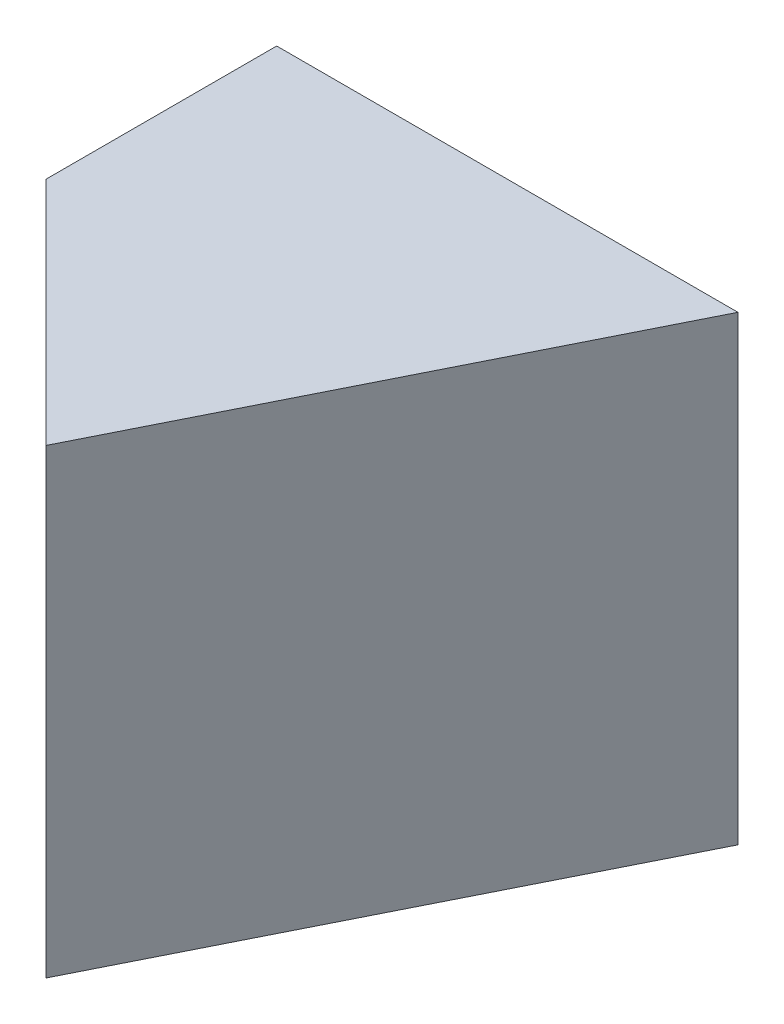
ISO-10303-21;
HEADER;
FILE_DESCRIPTION(('STEP AP214'),'2;1');
FILE_NAME('part.step','',(''),(''),'','','');
FILE_SCHEMA(('AUTOMOTIVE_DESIGN { 1 0 10303 214 1 1 1 1 }'));
ENDSEC;
DATA;
#1=APPLICATION_CONTEXT('core data for automotive mechanical design processes');
#2=APPLICATION_PROTOCOL_DEFINITION('international standard','automotive_design',2000,#1);
#3=PRODUCT_CONTEXT('',#1,'mechanical');
#4=PRODUCT('Part','Part','',(#3));
#5=PRODUCT_RELATED_PRODUCT_CATEGORY('part','',(#4));
#6=PRODUCT_DEFINITION_FORMATION('','',#4);
#7=PRODUCT_DEFINITION_CONTEXT('part definition',#1,'design');
#8=PRODUCT_DEFINITION('design','',#6,#7);
#9=PRODUCT_DEFINITION_SHAPE('','',#8);
#10=(LENGTH_UNIT() NAMED_UNIT(*) SI_UNIT(.MILLI.,.METRE.));
#11=(NAMED_UNIT(*) PLANE_ANGLE_UNIT() SI_UNIT($,.RADIAN.));
#12=(NAMED_UNIT(*) SI_UNIT($,.STERADIAN.) SOLID_ANGLE_UNIT());
#13=UNCERTAINTY_MEASURE_WITH_UNIT(LENGTH_MEASURE(1.E-05),#10,'distance_accuracy_value','');
#14=(GEOMETRIC_REPRESENTATION_CONTEXT(3) GLOBAL_UNCERTAINTY_ASSIGNED_CONTEXT((#13)) GLOBAL_UNIT_ASSIGNED_CONTEXT((#10,
#11,#12)) REPRESENTATION_CONTEXT('',''));
#15=CARTESIAN_POINT('',(0.,0.,0.));
#16=DIRECTION('',(0.,0.,1.));
#17=DIRECTION('',(1.,0.,0.));
#18=AXIS2_PLACEMENT_3D('',#15,#16,#17);
#19=CARTESIAN_POINT('',(0.,0.,20.));
#20=DIRECTION('',(1.,0.,0.));
#21=DIRECTION('',(0.,0.,-1.));
#22=AXIS2_PLACEMENT_3D('',#19,#20,#21);
#23=PLANE('',#22);
#24=DIRECTION('',(0.,0.,-1.));
#25=VECTOR('',#24,1.);
#26=CARTESIAN_POINT('',(0.,0.,20.));
#27=LINE('',#26,#25);
#28=CARTESIAN_POINT('',(0.,0.,10.));
#29=VERTEX_POINT('',#28);
#30=CARTESIAN_POINT('',(0.,0.,0.));
#31=VERTEX_POINT('',#30);
#32=EDGE_CURVE('E11',#29,#31,#27,.T.);
#33=ORIENTED_EDGE('',*,*,#32,.F.);
#34=DIRECTION('',(0.,1.,0.));
#35=VECTOR('',#34,1.);
#36=CARTESIAN_POINT('',(0.,0.,10.));
#37=LINE('',#36,#35);
#38=CARTESIAN_POINT('',(0.,20.,10.));
#39=VERTEX_POINT('',#38);
#40=EDGE_CURVE('E72',#29,#39,#37,.T.);
#41=ORIENTED_EDGE('',*,*,#40,.T.);
#42=DIRECTION('',(0.,0.,-1.));
#43=VECTOR('',#42,1.);
#44=CARTESIAN_POINT('',(0.,20.,20.));
#45=LINE('',#44,#43);
#46=CARTESIAN_POINT('',(0.,20.,0.));
#47=VERTEX_POINT('',#46);
#48=EDGE_CURVE('E40',#39,#47,#45,.T.);
#49=ORIENTED_EDGE('',*,*,#48,.T.);
#50=DIRECTION('',(0.,-1.,0.));
#51=VECTOR('',#50,1.);
#52=CARTESIAN_POINT('',(0.,0.,0.));
#53=LINE('',#52,#51);
#54=EDGE_CURVE('E86',#47,#31,#53,.T.);
#55=ORIENTED_EDGE('',*,*,#54,.T.);
#56=EDGE_LOOP('',(#33,#41,#49,#55));
#57=FACE_BOUND('',#56,.T.);
#58=ADVANCED_FACE('F33',(#57),#23,.F.);
#59=CARTESIAN_POINT('',(0.,0.,20.));
#60=DIRECTION('',(0.,1.,0.));
#61=DIRECTION('',(0.,0.,1.));
#62=AXIS2_PLACEMENT_3D('',#59,#60,#61);
#63=PLANE('',#62);
#64=DIRECTION('',(-0.447213595499958,0.,0.894427190999916));
#65=VECTOR('',#64,1.);
#66=CARTESIAN_POINT('',(20.,0.,0.));
#67=LINE('',#66,#65);
#68=CARTESIAN_POINT('',(20.,0.,0.));
#69=VERTEX_POINT('',#68);
#70=CARTESIAN_POINT('',(10.,0.,20.));
#71=VERTEX_POINT('',#70);
#72=EDGE_CURVE('E54',#69,#71,#67,.T.);
#73=ORIENTED_EDGE('',*,*,#72,.T.);
#74=DIRECTION('',(-0.707106781186548,0.,-0.707106781186548));
#75=VECTOR('',#74,1.);
#76=CARTESIAN_POINT('',(10.,0.,20.));
#77=LINE('',#76,#75);
#78=EDGE_CURVE('E75',#71,#29,#77,.T.);
#79=ORIENTED_EDGE('',*,*,#78,.T.);
#80=ORIENTED_EDGE('',*,*,#32,.T.);
#81=DIRECTION('',(1.,0.,0.));
#82=VECTOR('',#81,1.);
#83=CARTESIAN_POINT('',(0.,0.,0.));
#84=LINE('',#83,#82);
#85=EDGE_CURVE('E89',#31,#69,#84,.T.);
#86=ORIENTED_EDGE('',*,*,#85,.T.);
#87=EDGE_LOOP('',(#73,#79,#80,#86));
#88=FACE_BOUND('',#87,.T.);
#89=ADVANCED_FACE('F82',(#88),#63,.F.);
#90=CARTESIAN_POINT('',(0.,20.,20.));
#91=DIRECTION('',(0.,-1.,0.));
#92=DIRECTION('',(0.,0.,-1.));
#93=AXIS2_PLACEMENT_3D('',#90,#91,#92);
#94=PLANE('',#93);
#95=ORIENTED_EDGE('',*,*,#48,.F.);
#96=DIRECTION('',(-0.707106781186548,0.,-0.707106781186548));
#97=VECTOR('',#96,1.);
#98=CARTESIAN_POINT('',(10.,20.,20.));
#99=LINE('',#98,#97);
#100=CARTESIAN_POINT('',(10.,20.,20.));
#101=VERTEX_POINT('',#100);
#102=EDGE_CURVE('E77',#101,#39,#99,.T.);
#103=ORIENTED_EDGE('',*,*,#102,.F.);
#104=DIRECTION('',(-0.447213595499958,0.,0.894427190999916));
#105=VECTOR('',#104,1.);
#106=CARTESIAN_POINT('',(20.,20.,0.));
#107=LINE('',#106,#105);
#108=CARTESIAN_POINT('',(20.,20.,0.));
#109=VERTEX_POINT('',#108);
#110=EDGE_CURVE('E79',#109,#101,#107,.T.);
#111=ORIENTED_EDGE('',*,*,#110,.F.);
#112=DIRECTION('',(-1.,0.,0.));
#113=VECTOR('',#112,1.);
#114=CARTESIAN_POINT('',(0.,20.,0.));
#115=LINE('',#114,#113);
#116=EDGE_CURVE('E98',#109,#47,#115,.T.);
#117=ORIENTED_EDGE('',*,*,#116,.T.);
#118=EDGE_LOOP('',(#95,#103,#111,#117));
#119=FACE_BOUND('',#118,.T.);
#120=ADVANCED_FACE('F101',(#119),#94,.F.);
#121=CARTESIAN_POINT('',(0.,0.,0.));
#122=DIRECTION('',(0.,0.,-1.));
#123=DIRECTION('',(-1.,0.,0.));
#124=AXIS2_PLACEMENT_3D('',#121,#122,#123);
#125=PLANE('',#124);
#126=ORIENTED_EDGE('',*,*,#54,.F.);
#127=ORIENTED_EDGE('',*,*,#116,.F.);
#128=DIRECTION('',(0.,1.,0.));
#129=VECTOR('',#128,1.);
#130=CARTESIAN_POINT('',(20.,0.,0.));
#131=LINE('',#130,#129);
#132=EDGE_CURVE('E92',#69,#109,#131,.T.);
#133=ORIENTED_EDGE('',*,*,#132,.F.);
#134=ORIENTED_EDGE('',*,*,#85,.F.);
#135=EDGE_LOOP('',(#126,#127,#133,#134));
#136=FACE_BOUND('',#135,.T.);
#137=ADVANCED_FACE('F104',(#136),#125,.T.);
#138=CARTESIAN_POINT('',(20.,0.,0.));
#139=DIRECTION('',(-0.894427190999916,0.,-0.447213595499958));
#140=DIRECTION('',(-0.447213595499958,0.,0.894427190999916));
#141=AXIS2_PLACEMENT_3D('',#138,#139,#140);
#142=PLANE('',#141);
#143=ORIENTED_EDGE('',*,*,#110,.T.);
#144=DIRECTION('',(0.,1.,0.));
#145=VECTOR('',#144,1.);
#146=CARTESIAN_POINT('',(10.,0.,20.));
#147=LINE('',#146,#145);
#148=EDGE_CURVE('E90',#71,#101,#147,.T.);
#149=ORIENTED_EDGE('',*,*,#148,.F.);
#150=ORIENTED_EDGE('',*,*,#72,.F.);
#151=ORIENTED_EDGE('',*,*,#132,.T.);
#152=EDGE_LOOP('',(#143,#149,#150,#151));
#153=FACE_BOUND('',#152,.T.);
#154=ADVANCED_FACE('F105',(#153),#142,.F.);
#155=CARTESIAN_POINT('',(10.,0.,20.));
#156=DIRECTION('',(0.707106781186548,0.,-0.707106781186548));
#157=DIRECTION('',(-0.707106781186548,0.,-0.707106781186548));
#158=AXIS2_PLACEMENT_3D('',#155,#156,#157);
#159=PLANE('',#158);
#160=ORIENTED_EDGE('',*,*,#102,.T.);
#161=ORIENTED_EDGE('',*,*,#40,.F.);
#162=ORIENTED_EDGE('',*,*,#78,.F.);
#163=ORIENTED_EDGE('',*,*,#148,.T.);
#164=EDGE_LOOP('',(#160,#161,#162,#163));
#165=FACE_BOUND('',#164,.T.);
#166=ADVANCED_FACE('F74',(#165),#159,.F.);
#167=CLOSED_SHELL('',(#58,#89,#120,#137,#154,#166));
#168=MANIFOLD_SOLID_BREP('B2',#167);
#169=ADVANCED_BREP_SHAPE_REPRESENTATION('',(#18,#168),#14);
#170=SHAPE_DEFINITION_REPRESENTATION(#9,#169);
ENDSEC;
END-ISO-10303-21;
